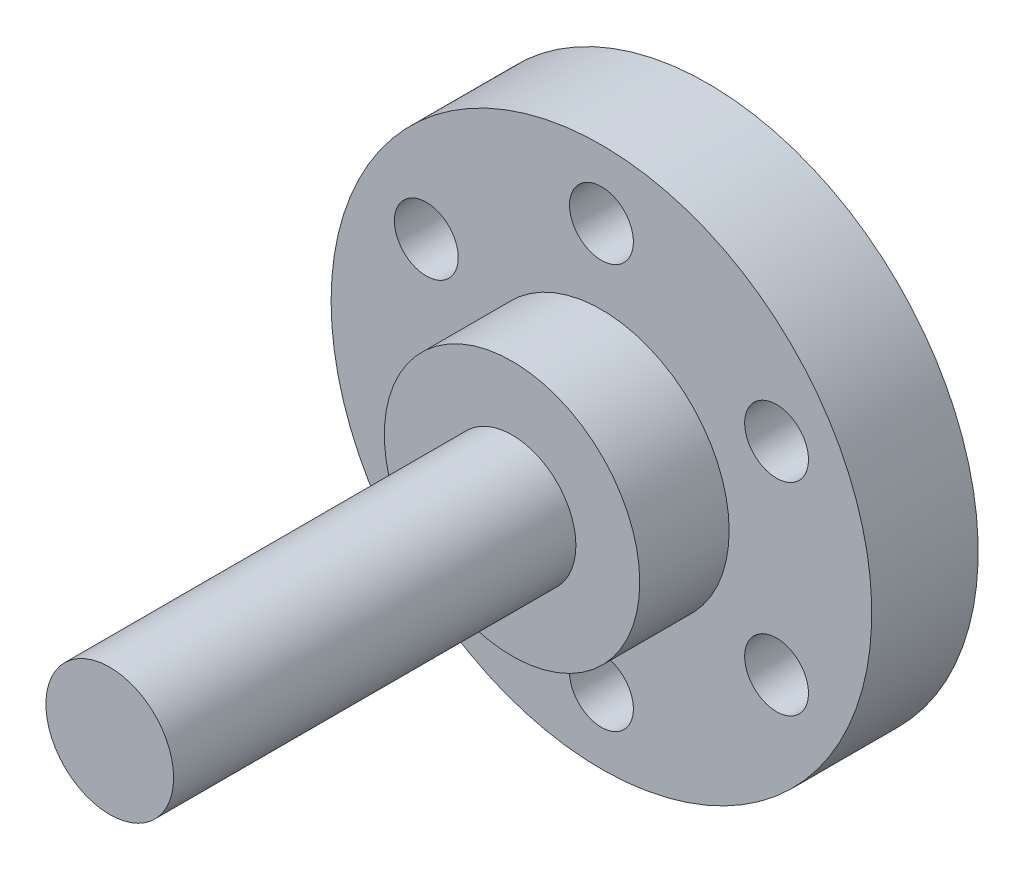
ISO-10303-21;
HEADER;
FILE_DESCRIPTION(('STEP AP214'),'2;1');
FILE_NAME('part.step','',(''),(''),'','','');
FILE_SCHEMA(('AUTOMOTIVE_DESIGN { 1 0 10303 214 1 1 1 1 }'));
ENDSEC;
DATA;
#1=APPLICATION_CONTEXT('core data for automotive mechanical design processes');
#2=APPLICATION_PROTOCOL_DEFINITION('international standard','automotive_design',2000,#1);
#3=PRODUCT_CONTEXT('',#1,'mechanical');
#4=PRODUCT('Part','Part','',(#3));
#5=PRODUCT_RELATED_PRODUCT_CATEGORY('part','',(#4));
#6=PRODUCT_DEFINITION_FORMATION('','',#4);
#7=PRODUCT_DEFINITION_CONTEXT('part definition',#1,'design');
#8=PRODUCT_DEFINITION('design','',#6,#7);
#9=PRODUCT_DEFINITION_SHAPE('','',#8);
#10=(LENGTH_UNIT() NAMED_UNIT(*) SI_UNIT(.MILLI.,.METRE.));
#11=(NAMED_UNIT(*) PLANE_ANGLE_UNIT() SI_UNIT($,.RADIAN.));
#12=(NAMED_UNIT(*) SI_UNIT($,.STERADIAN.) SOLID_ANGLE_UNIT());
#13=UNCERTAINTY_MEASURE_WITH_UNIT(LENGTH_MEASURE(1.E-05),#10,'distance_accuracy_value','');
#14=(GEOMETRIC_REPRESENTATION_CONTEXT(3) GLOBAL_UNCERTAINTY_ASSIGNED_CONTEXT((#13)) GLOBAL_UNIT_ASSIGNED_CONTEXT((#10,
#11,#12)) REPRESENTATION_CONTEXT('',''));
#15=CARTESIAN_POINT('',(0.,0.,0.));
#16=DIRECTION('',(0.,0.,1.));
#17=DIRECTION('',(1.,0.,0.));
#18=AXIS2_PLACEMENT_3D('',#15,#16,#17);
#19=CARTESIAN_POINT('',(0.,0.,5.9));
#20=DIRECTION('',(0.,0.,1.));
#21=DIRECTION('',(1.,0.,0.));
#22=AXIS2_PLACEMENT_3D('',#19,#20,#21);
#23=CYLINDRICAL_SURFACE('',#22,6.);
#24=CARTESIAN_POINT('',(0.,0.,5.9));
#25=DIRECTION('',(0.,0.,-1.));
#26=DIRECTION('',(-1.,0.,0.));
#27=AXIS2_PLACEMENT_3D('',#24,#25,#26);
#28=CIRCLE('',#27,6.);
#29=CARTESIAN_POINT('',(-6.,0.,5.9));
#30=VERTEX_POINT('',#29);
#31=EDGE_CURVE('E47',#30,#30,#28,.F.);
#32=ORIENTED_EDGE('',*,*,#31,.T.);
#33=EDGE_LOOP('',(#32));
#34=FACE_BOUND('',#33,.T.);
#35=CARTESIAN_POINT('',(0.,0.,10.1));
#36=DIRECTION('',(0.,0.,1.));
#37=DIRECTION('',(1.,0.,0.));
#38=AXIS2_PLACEMENT_3D('',#35,#36,#37);
#39=CIRCLE('',#38,6.);
#40=CARTESIAN_POINT('',(6.,0.,10.1));
#41=VERTEX_POINT('',#40);
#42=EDGE_CURVE('E56',#41,#41,#39,.T.);
#43=ORIENTED_EDGE('',*,*,#42,.F.);
#44=EDGE_LOOP('',(#43));
#45=FACE_BOUND('',#44,.T.);
#46=ADVANCED_FACE('F31',(#34,#45),#23,.T.);
#47=CARTESIAN_POINT('',(0.,0.,0.9));
#48=DIRECTION('',(0.,0.,-1.));
#49=DIRECTION('',(-1.,0.,0.));
#50=AXIS2_PLACEMENT_3D('',#47,#48,#49);
#51=PLANE('',#50);
#52=CARTESIAN_POINT('',(8.22724133595197,4.74999999999964,0.9));
#53=DIRECTION('',(0.,0.,-1.));
#54=DIRECTION('',(-1.,0.,0.));
#55=AXIS2_PLACEMENT_3D('',#52,#53,#54);
#56=CIRCLE('',#55,1.5);
#57=CARTESIAN_POINT('',(6.72724133595197,4.74999999999964,0.9));
#58=VERTEX_POINT('',#57);
#59=EDGE_CURVE('E84',#58,#58,#56,.T.);
#60=ORIENTED_EDGE('',*,*,#59,.F.);
#61=EDGE_LOOP('',(#60));
#62=FACE_BOUND('',#61,.T.);
#63=CARTESIAN_POINT('',(8.22724133595156,-4.75000000000035,0.9));
#64=DIRECTION('',(0.,0.,-1.));
#65=DIRECTION('',(-1.,0.,0.));
#66=AXIS2_PLACEMENT_3D('',#63,#64,#65);
#67=CIRCLE('',#66,1.5);
#68=CARTESIAN_POINT('',(6.72724133595156,-4.75000000000035,0.9));
#69=VERTEX_POINT('',#68);
#70=EDGE_CURVE('E74',#69,#69,#67,.T.);
#71=ORIENTED_EDGE('',*,*,#70,.F.);
#72=EDGE_LOOP('',(#71));
#73=FACE_BOUND('',#72,.T.);
#74=CARTESIAN_POINT('',(-8.07691889848134E-13,-9.5,0.9));
#75=DIRECTION('',(0.,0.,-1.));
#76=DIRECTION('',(-1.,0.,0.));
#77=AXIS2_PLACEMENT_3D('',#74,#75,#76);
#78=CIRCLE('',#77,1.5);
#79=CARTESIAN_POINT('',(-1.50000000000081,-9.5,0.9));
#80=VERTEX_POINT('',#79);
#81=EDGE_CURVE('E71',#80,#80,#78,.T.);
#82=ORIENTED_EDGE('',*,*,#81,.F.);
#83=EDGE_LOOP('',(#82));
#84=FACE_BOUND('',#83,.T.);
#85=CARTESIAN_POINT('',(-8.22724133595277,-4.74999999999965,0.9));
#86=DIRECTION('',(0.,0.,-1.));
#87=DIRECTION('',(-1.,0.,0.));
#88=AXIS2_PLACEMENT_3D('',#85,#86,#87);
#89=CIRCLE('',#88,1.5);
#90=CARTESIAN_POINT('',(-9.72724133595277,-4.74999999999965,0.9));
#91=VERTEX_POINT('',#90);
#92=EDGE_CURVE('E68',#91,#91,#89,.T.);
#93=ORIENTED_EDGE('',*,*,#92,.F.);
#94=EDGE_LOOP('',(#93));
#95=FACE_BOUND('',#94,.T.);
#96=CARTESIAN_POINT('',(-8.22724133595237,4.75000000000035,0.9));
#97=DIRECTION('',(0.,0.,-1.));
#98=DIRECTION('',(-1.,0.,0.));
#99=AXIS2_PLACEMENT_3D('',#96,#97,#98);
#100=CIRCLE('',#99,1.5);
#101=CARTESIAN_POINT('',(-9.72724133595237,4.75000000000035,0.9));
#102=VERTEX_POINT('',#101);
#103=EDGE_CURVE('E64',#102,#102,#100,.T.);
#104=ORIENTED_EDGE('',*,*,#103,.F.);
#105=EDGE_LOOP('',(#104));
#106=FACE_BOUND('',#105,.T.);
#107=CARTESIAN_POINT('',(0.,9.5,0.9));
#108=DIRECTION('',(0.,0.,-1.));
#109=DIRECTION('',(-1.,0.,0.));
#110=AXIS2_PLACEMENT_3D('',#107,#108,#109);
#111=CIRCLE('',#110,1.5);
#112=CARTESIAN_POINT('',(-1.5,9.5,0.9));
#113=VERTEX_POINT('',#112);
#114=EDGE_CURVE('E60',#113,#113,#111,.T.);
#115=ORIENTED_EDGE('',*,*,#114,.F.);
#116=EDGE_LOOP('',(#115));
#117=FACE_BOUND('',#116,.T.);
#118=CARTESIAN_POINT('',(0.,0.,0.9));
#119=DIRECTION('',(0.,0.,-1.));
#120=DIRECTION('',(-1.,0.,0.));
#121=AXIS2_PLACEMENT_3D('',#118,#119,#120);
#122=CIRCLE('',#121,12.7);
#123=CARTESIAN_POINT('',(-12.7,0.,0.9));
#124=VERTEX_POINT('',#123);
#125=EDGE_CURVE('E95',#124,#124,#122,.T.);
#126=ORIENTED_EDGE('',*,*,#125,.T.);
#127=EDGE_LOOP('',(#126));
#128=FACE_BOUND('',#127,.T.);
#129=CARTESIAN_POINT('',(0.,0.,0.900000000000001));
#130=DIRECTION('',(0.,0.,-1.));
#131=DIRECTION('',(-1.,0.,0.));
#132=AXIS2_PLACEMENT_3D('',#129,#130,#131);
#133=CIRCLE('',#132,3.);
#134=CARTESIAN_POINT('',(-3.,0.,0.900000000000001));
#135=VERTEX_POINT('',#134);
#136=EDGE_CURVE('E44',#135,#135,#133,.T.);
#137=ORIENTED_EDGE('',*,*,#136,.F.);
#138=EDGE_LOOP('',(#137));
#139=FACE_BOUND('',#138,.T.);
#140=ADVANCED_FACE('F113',(#62,#73,#84,#95,#106,#117,#128,#139),#51,.T.);
#141=CARTESIAN_POINT('',(0.,0.,0.9));
#142=DIRECTION('',(0.,0.,1.));
#143=DIRECTION('',(1.,0.,0.));
#144=AXIS2_PLACEMENT_3D('',#141,#142,#143);
#145=CYLINDRICAL_SURFACE('',#144,12.7);
#146=ORIENTED_EDGE('',*,*,#125,.F.);
#147=EDGE_LOOP('',(#146));
#148=FACE_BOUND('',#147,.T.);
#149=CARTESIAN_POINT('',(0.,0.,5.9));
#150=DIRECTION('',(0.,0.,-1.));
#151=DIRECTION('',(-1.,0.,0.));
#152=AXIS2_PLACEMENT_3D('',#149,#150,#151);
#153=CIRCLE('',#152,12.7);
#154=CARTESIAN_POINT('',(-12.7,0.,5.9));
#155=VERTEX_POINT('',#154);
#156=EDGE_CURVE('E55',#155,#155,#153,.T.);
#157=ORIENTED_EDGE('',*,*,#156,.T.);
#158=EDGE_LOOP('',(#157));
#159=FACE_BOUND('',#158,.T.);
#160=ADVANCED_FACE('F100',(#148,#159),#145,.T.);
#161=CARTESIAN_POINT('',(0.,0.,5.9));
#162=DIRECTION('',(0.,0.,-1.));
#163=DIRECTION('',(-1.,0.,0.));
#164=AXIS2_PLACEMENT_3D('',#161,#162,#163);
#165=PLANE('',#164);
#166=CARTESIAN_POINT('',(8.22724133595197,4.74999999999964,5.9));
#167=DIRECTION('',(0.,0.,-1.));
#168=DIRECTION('',(-1.,0.,0.));
#169=AXIS2_PLACEMENT_3D('',#166,#167,#168);
#170=CIRCLE('',#169,1.5);
#171=CARTESIAN_POINT('',(6.72724133595197,4.74999999999964,5.9));
#172=VERTEX_POINT('',#171);
#173=EDGE_CURVE('E35',#172,#172,#170,.T.);
#174=ORIENTED_EDGE('',*,*,#173,.T.);
#175=EDGE_LOOP('',(#174));
#176=FACE_BOUND('',#175,.T.);
#177=CARTESIAN_POINT('',(8.22724133595156,-4.75000000000035,5.9));
#178=DIRECTION('',(0.,0.,-1.));
#179=DIRECTION('',(-1.,0.,0.));
#180=AXIS2_PLACEMENT_3D('',#177,#178,#179);
#181=CIRCLE('',#180,1.5);
#182=CARTESIAN_POINT('',(6.72724133595156,-4.75000000000035,5.9));
#183=VERTEX_POINT('',#182);
#184=EDGE_CURVE('E72',#183,#183,#181,.T.);
#185=ORIENTED_EDGE('',*,*,#184,.T.);
#186=EDGE_LOOP('',(#185));
#187=FACE_BOUND('',#186,.T.);
#188=CARTESIAN_POINT('',(-8.07691889848134E-13,-9.5,5.9));
#189=DIRECTION('',(0.,0.,-1.));
#190=DIRECTION('',(-1.,0.,0.));
#191=AXIS2_PLACEMENT_3D('',#188,#189,#190);
#192=CIRCLE('',#191,1.5);
#193=CARTESIAN_POINT('',(-1.50000000000081,-9.5,5.9));
#194=VERTEX_POINT('',#193);
#195=EDGE_CURVE('E69',#194,#194,#192,.T.);
#196=ORIENTED_EDGE('',*,*,#195,.T.);
#197=EDGE_LOOP('',(#196));
#198=FACE_BOUND('',#197,.T.);
#199=CARTESIAN_POINT('',(-8.22724133595277,-4.74999999999965,5.9));
#200=DIRECTION('',(0.,0.,-1.));
#201=DIRECTION('',(-1.,0.,0.));
#202=AXIS2_PLACEMENT_3D('',#199,#200,#201);
#203=CIRCLE('',#202,1.5);
#204=CARTESIAN_POINT('',(-9.72724133595277,-4.74999999999965,5.9));
#205=VERTEX_POINT('',#204);
#206=EDGE_CURVE('E65',#205,#205,#203,.T.);
#207=ORIENTED_EDGE('',*,*,#206,.T.);
#208=EDGE_LOOP('',(#207));
#209=FACE_BOUND('',#208,.T.);
#210=CARTESIAN_POINT('',(-8.22724133595237,4.75000000000035,5.9));
#211=DIRECTION('',(0.,0.,-1.));
#212=DIRECTION('',(-1.,0.,0.));
#213=AXIS2_PLACEMENT_3D('',#210,#211,#212);
#214=CIRCLE('',#213,1.5);
#215=CARTESIAN_POINT('',(-9.72724133595237,4.75000000000035,5.9));
#216=VERTEX_POINT('',#215);
#217=EDGE_CURVE('E61',#216,#216,#214,.T.);
#218=ORIENTED_EDGE('',*,*,#217,.T.);
#219=EDGE_LOOP('',(#218));
#220=FACE_BOUND('',#219,.T.);
#221=CARTESIAN_POINT('',(0.,9.5,5.9));
#222=DIRECTION('',(0.,0.,-1.));
#223=DIRECTION('',(-1.,0.,0.));
#224=AXIS2_PLACEMENT_3D('',#221,#222,#223);
#225=CIRCLE('',#224,1.5);
#226=CARTESIAN_POINT('',(-1.5,9.5,5.9));
#227=VERTEX_POINT('',#226);
#228=EDGE_CURVE('E57',#227,#227,#225,.T.);
#229=ORIENTED_EDGE('',*,*,#228,.T.);
#230=EDGE_LOOP('',(#229));
#231=FACE_BOUND('',#230,.T.);
#232=ORIENTED_EDGE('',*,*,#31,.F.);
#233=EDGE_LOOP('',(#232));
#234=FACE_BOUND('',#233,.T.);
#235=ORIENTED_EDGE('',*,*,#156,.F.);
#236=EDGE_LOOP('',(#235));
#237=FACE_BOUND('',#236,.T.);
#238=ADVANCED_FACE('F102',(#176,#187,#198,#209,#220,#231,#234,#237),#165,.F.);
#239=CARTESIAN_POINT('',(0.,0.,0.));
#240=DIRECTION('',(0.,0.,1.));
#241=DIRECTION('',(1.,0.,0.));
#242=AXIS2_PLACEMENT_3D('',#239,#240,#241);
#243=PLANE('',#242);
#244=CARTESIAN_POINT('',(0.,0.,0.));
#245=DIRECTION('',(0.,0.,1.));
#246=DIRECTION('',(1.,0.,0.));
#247=AXIS2_PLACEMENT_3D('',#244,#245,#246);
#248=CIRCLE('',#247,3.);
#249=CARTESIAN_POINT('',(3.,0.,0.));
#250=VERTEX_POINT('',#249);
#251=EDGE_CURVE('E39',#250,#250,#248,.T.);
#252=ORIENTED_EDGE('',*,*,#251,.F.);
#253=EDGE_LOOP('',(#252));
#254=FACE_BOUND('',#253,.T.);
#255=ADVANCED_FACE('F104',(#254),#243,.F.);
#256=CARTESIAN_POINT('',(0.,0.,29.));
#257=DIRECTION('',(0.,0.,-1.));
#258=DIRECTION('',(-1.,0.,0.));
#259=AXIS2_PLACEMENT_3D('',#256,#257,#258);
#260=CYLINDRICAL_SURFACE('',#259,3.);
#261=ORIENTED_EDGE('',*,*,#136,.T.);
#262=EDGE_LOOP('',(#261));
#263=FACE_BOUND('',#262,.T.);
#264=ORIENTED_EDGE('',*,*,#251,.T.);
#265=EDGE_LOOP('',(#264));
#266=FACE_BOUND('',#265,.T.);
#267=ADVANCED_FACE('F111',(#263,#266),#260,.T.);
#268=CARTESIAN_POINT('',(0.,0.,10.1));
#269=DIRECTION('',(0.,0.,1.));
#270=DIRECTION('',(1.,0.,0.));
#271=AXIS2_PLACEMENT_3D('',#268,#269,#270);
#272=PLANE('',#271);
#273=ORIENTED_EDGE('',*,*,#42,.T.);
#274=EDGE_LOOP('',(#273));
#275=FACE_BOUND('',#274,.T.);
#276=CARTESIAN_POINT('',(0.,0.,10.1));
#277=DIRECTION('',(0.,0.,1.));
#278=DIRECTION('',(1.,0.,0.));
#279=AXIS2_PLACEMENT_3D('',#276,#277,#278);
#280=CIRCLE('',#279,3.);
#281=CARTESIAN_POINT('',(3.,0.,10.1));
#282=VERTEX_POINT('',#281);
#283=EDGE_CURVE('E52',#282,#282,#280,.T.);
#284=ORIENTED_EDGE('',*,*,#283,.F.);
#285=EDGE_LOOP('',(#284));
#286=FACE_BOUND('',#285,.T.);
#287=ADVANCED_FACE('F129',(#275,#286),#272,.T.);
#288=CARTESIAN_POINT('',(0.,0.,29.));
#289=DIRECTION('',(0.,0.,1.));
#290=DIRECTION('',(1.,0.,0.));
#291=AXIS2_PLACEMENT_3D('',#288,#289,#290);
#292=PLANE('',#291);
#293=CARTESIAN_POINT('',(0.,0.,29.));
#294=DIRECTION('',(0.,0.,1.));
#295=DIRECTION('',(1.,0.,0.));
#296=AXIS2_PLACEMENT_3D('',#293,#294,#295);
#297=CIRCLE('',#296,3.);
#298=CARTESIAN_POINT('',(3.,0.,29.));
#299=VERTEX_POINT('',#298);
#300=EDGE_CURVE('E10',#299,#299,#297,.T.);
#301=ORIENTED_EDGE('',*,*,#300,.T.);
#302=EDGE_LOOP('',(#301));
#303=FACE_BOUND('',#302,.T.);
#304=ADVANCED_FACE('F127',(#303),#292,.T.);
#305=ORIENTED_EDGE('',*,*,#283,.T.);
#306=EDGE_LOOP('',(#305));
#307=FACE_BOUND('',#306,.T.);
#308=ORIENTED_EDGE('',*,*,#300,.F.);
#309=EDGE_LOOP('',(#308));
#310=FACE_BOUND('',#309,.T.);
#311=ADVANCED_FACE('F33',(#307,#310),#260,.T.);
#312=CARTESIAN_POINT('',(0.,9.5,10.9));
#313=DIRECTION('',(0.,0.,-1.));
#314=DIRECTION('',(-1.,0.,0.));
#315=AXIS2_PLACEMENT_3D('',#312,#313,#314);
#316=CYLINDRICAL_SURFACE('',#315,1.5);
#317=ORIENTED_EDGE('',*,*,#114,.T.);
#318=EDGE_LOOP('',(#317));
#319=FACE_BOUND('',#318,.T.);
#320=ORIENTED_EDGE('',*,*,#228,.F.);
#321=EDGE_LOOP('',(#320));
#322=FACE_BOUND('',#321,.T.);
#323=ADVANCED_FACE('F134',(#319,#322),#316,.F.);
#324=CARTESIAN_POINT('',(-8.22724133595237,4.75000000000035,10.9));
#325=DIRECTION('',(0.,0.,-1.));
#326=DIRECTION('',(-1.,0.,0.));
#327=AXIS2_PLACEMENT_3D('',#324,#325,#326);
#328=CYLINDRICAL_SURFACE('',#327,1.5);
#329=ORIENTED_EDGE('',*,*,#103,.T.);
#330=EDGE_LOOP('',(#329));
#331=FACE_BOUND('',#330,.T.);
#332=ORIENTED_EDGE('',*,*,#217,.F.);
#333=EDGE_LOOP('',(#332));
#334=FACE_BOUND('',#333,.T.);
#335=ADVANCED_FACE('F146',(#331,#334),#328,.F.);
#336=CARTESIAN_POINT('',(-8.22724133595277,-4.74999999999965,10.9));
#337=DIRECTION('',(0.,0.,-1.));
#338=DIRECTION('',(-1.,0.,0.));
#339=AXIS2_PLACEMENT_3D('',#336,#337,#338);
#340=CYLINDRICAL_SURFACE('',#339,1.5);
#341=ORIENTED_EDGE('',*,*,#92,.T.);
#342=EDGE_LOOP('',(#341));
#343=FACE_BOUND('',#342,.T.);
#344=ORIENTED_EDGE('',*,*,#206,.F.);
#345=EDGE_LOOP('',(#344));
#346=FACE_BOUND('',#345,.T.);
#347=ADVANCED_FACE('F150',(#343,#346),#340,.F.);
#348=CARTESIAN_POINT('',(-8.07691889848134E-13,-9.5,10.9));
#349=DIRECTION('',(0.,0.,-1.));
#350=DIRECTION('',(-1.,0.,0.));
#351=AXIS2_PLACEMENT_3D('',#348,#349,#350);
#352=CYLINDRICAL_SURFACE('',#351,1.5);
#353=ORIENTED_EDGE('',*,*,#81,.T.);
#354=EDGE_LOOP('',(#353));
#355=FACE_BOUND('',#354,.T.);
#356=ORIENTED_EDGE('',*,*,#195,.F.);
#357=EDGE_LOOP('',(#356));
#358=FACE_BOUND('',#357,.T.);
#359=ADVANCED_FACE('F154',(#355,#358),#352,.F.);
#360=CARTESIAN_POINT('',(8.22724133595156,-4.75000000000035,10.9));
#361=DIRECTION('',(0.,0.,-1.));
#362=DIRECTION('',(-1.,0.,0.));
#363=AXIS2_PLACEMENT_3D('',#360,#361,#362);
#364=CYLINDRICAL_SURFACE('',#363,1.5);
#365=ORIENTED_EDGE('',*,*,#70,.T.);
#366=EDGE_LOOP('',(#365));
#367=FACE_BOUND('',#366,.T.);
#368=ORIENTED_EDGE('',*,*,#184,.F.);
#369=EDGE_LOOP('',(#368));
#370=FACE_BOUND('',#369,.T.);
#371=ADVANCED_FACE('F158',(#367,#370),#364,.F.);
#372=CARTESIAN_POINT('',(8.22724133595197,4.74999999999964,10.9));
#373=DIRECTION('',(0.,0.,-1.));
#374=DIRECTION('',(-1.,0.,0.));
#375=AXIS2_PLACEMENT_3D('',#372,#373,#374);
#376=CYLINDRICAL_SURFACE('',#375,1.5);
#377=ORIENTED_EDGE('',*,*,#59,.T.);
#378=EDGE_LOOP('',(#377));
#379=FACE_BOUND('',#378,.T.);
#380=ORIENTED_EDGE('',*,*,#173,.F.);
#381=EDGE_LOOP('',(#380));
#382=FACE_BOUND('',#381,.T.);
#383=ADVANCED_FACE('F162',(#379,#382),#376,.F.);
#384=CLOSED_SHELL('',(#46,#140,#160,#238,#255,#267,#287,#304,#311,#323,#335,#347,#359,#371,#383));
#385=MANIFOLD_SOLID_BREP('B2',#384);
#386=ADVANCED_BREP_SHAPE_REPRESENTATION('',(#18,#385),#14);
#387=SHAPE_DEFINITION_REPRESENTATION(#9,#386);
ENDSEC;
END-ISO-10303-21;
